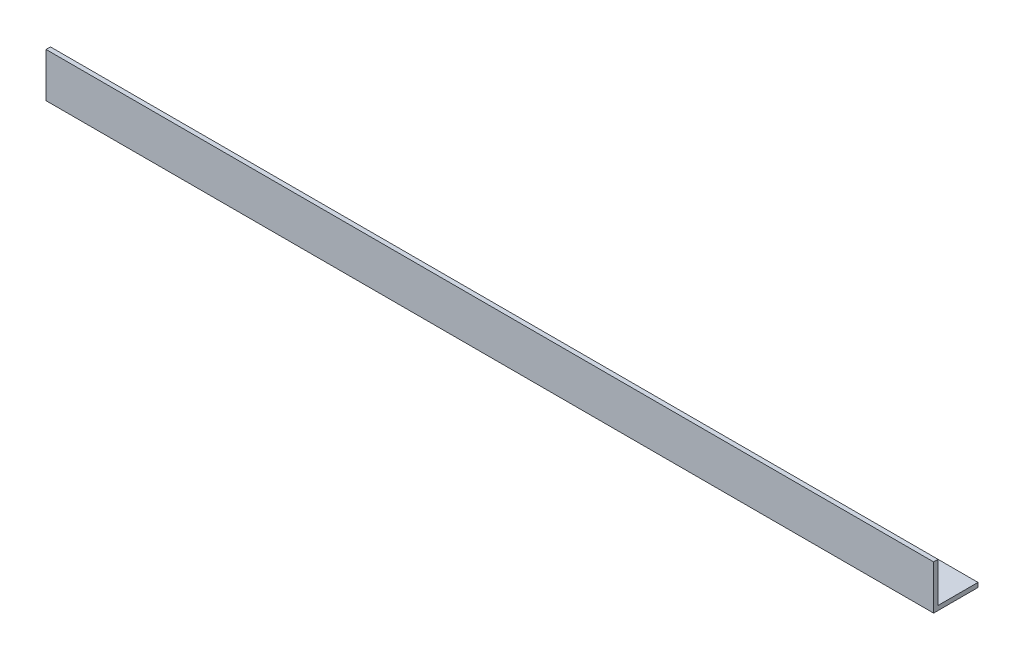
ISO-10303-21;
HEADER;
FILE_DESCRIPTION(('STEP AP214'),'2;1');
FILE_NAME('part.step','',(''),(''),'','','');
FILE_SCHEMA(('AUTOMOTIVE_DESIGN { 1 0 10303 214 1 1 1 1 }'));
ENDSEC;
DATA;
#1=APPLICATION_CONTEXT('core data for automotive mechanical design processes');
#2=APPLICATION_PROTOCOL_DEFINITION('international standard','automotive_design',2000,#1);
#3=PRODUCT_CONTEXT('',#1,'mechanical');
#4=PRODUCT('Part','Part','',(#3));
#5=PRODUCT_RELATED_PRODUCT_CATEGORY('part','',(#4));
#6=PRODUCT_DEFINITION_FORMATION('','',#4);
#7=PRODUCT_DEFINITION_CONTEXT('part definition',#1,'design');
#8=PRODUCT_DEFINITION('design','',#6,#7);
#9=PRODUCT_DEFINITION_SHAPE('','',#8);
#10=(LENGTH_UNIT() NAMED_UNIT(*) SI_UNIT(.MILLI.,.METRE.));
#11=(NAMED_UNIT(*) PLANE_ANGLE_UNIT() SI_UNIT($,.RADIAN.));
#12=(NAMED_UNIT(*) SI_UNIT($,.STERADIAN.) SOLID_ANGLE_UNIT());
#13=UNCERTAINTY_MEASURE_WITH_UNIT(LENGTH_MEASURE(1.E-05),#10,'distance_accuracy_value','');
#14=(GEOMETRIC_REPRESENTATION_CONTEXT(3) GLOBAL_UNCERTAINTY_ASSIGNED_CONTEXT((#13)) GLOBAL_UNIT_ASSIGNED_CONTEXT((#10,
#11,#12)) REPRESENTATION_CONTEXT('',''));
#15=CARTESIAN_POINT('',(0.,0.,0.));
#16=DIRECTION('',(0.,0.,1.));
#17=DIRECTION('',(1.,0.,0.));
#18=AXIS2_PLACEMENT_3D('',#15,#16,#17);
#19=CARTESIAN_POINT('',(300.,0.,-15.));
#20=DIRECTION('',(0.,1.,0.));
#21=DIRECTION('',(0.,0.,1.));
#22=AXIS2_PLACEMENT_3D('',#19,#20,#21);
#23=PLANE('',#22);
#24=DIRECTION('',(0.,0.,-1.));
#25=VECTOR('',#24,1.);
#26=CARTESIAN_POINT('',(0.,0.,-15.));
#27=LINE('',#26,#25);
#28=CARTESIAN_POINT('',(0.,0.,0.));
#29=VERTEX_POINT('',#28);
#30=CARTESIAN_POINT('',(0.,0.,-15.));
#31=VERTEX_POINT('',#30);
#32=EDGE_CURVE('E119',#29,#31,#27,.T.);
#33=ORIENTED_EDGE('',*,*,#32,.T.);
#34=DIRECTION('',(-1.,0.,0.));
#35=VECTOR('',#34,1.);
#36=CARTESIAN_POINT('',(300.,0.,-15.));
#37=LINE('',#36,#35);
#38=CARTESIAN_POINT('',(300.,0.,-15.));
#39=VERTEX_POINT('',#38);
#40=EDGE_CURVE('E11',#39,#31,#37,.T.);
#41=ORIENTED_EDGE('',*,*,#40,.F.);
#42=DIRECTION('',(0.,0.,-1.));
#43=VECTOR('',#42,1.);
#44=CARTESIAN_POINT('',(300.,0.,-15.));
#45=LINE('',#44,#43);
#46=CARTESIAN_POINT('',(300.,0.,0.));
#47=VERTEX_POINT('',#46);
#48=EDGE_CURVE('E129',#47,#39,#45,.T.);
#49=ORIENTED_EDGE('',*,*,#48,.F.);
#50=DIRECTION('',(-1.,0.,0.));
#51=VECTOR('',#50,1.);
#52=CARTESIAN_POINT('',(300.,0.,0.));
#53=LINE('',#52,#51);
#54=EDGE_CURVE('E115',#47,#29,#53,.T.);
#55=ORIENTED_EDGE('',*,*,#54,.T.);
#56=EDGE_LOOP('',(#33,#41,#49,#55));
#57=FACE_BOUND('',#56,.T.);
#58=ADVANCED_FACE('F35',(#57),#23,.F.);
#59=CARTESIAN_POINT('',(300.,1.49999999999998,-15.));
#60=DIRECTION('',(0.,0.,1.));
#61=DIRECTION('',(1.,0.,0.));
#62=AXIS2_PLACEMENT_3D('',#59,#60,#61);
#63=PLANE('',#62);
#64=DIRECTION('',(0.,1.,0.));
#65=VECTOR('',#64,1.);
#66=CARTESIAN_POINT('',(0.,1.49999999999998,-15.));
#67=LINE('',#66,#65);
#68=CARTESIAN_POINT('',(0.,1.49999999999998,-15.));
#69=VERTEX_POINT('',#68);
#70=EDGE_CURVE('E122',#31,#69,#67,.T.);
#71=ORIENTED_EDGE('',*,*,#70,.T.);
#72=DIRECTION('',(-1.,0.,0.));
#73=VECTOR('',#72,1.);
#74=CARTESIAN_POINT('',(300.,1.49999999999998,-15.));
#75=LINE('',#74,#73);
#76=CARTESIAN_POINT('',(300.,1.49999999999998,-15.));
#77=VERTEX_POINT('',#76);
#78=EDGE_CURVE('E43',#77,#69,#75,.T.);
#79=ORIENTED_EDGE('',*,*,#78,.F.);
#80=DIRECTION('',(0.,1.,0.));
#81=VECTOR('',#80,1.);
#82=CARTESIAN_POINT('',(300.,1.49999999999998,-15.));
#83=LINE('',#82,#81);
#84=EDGE_CURVE('E88',#39,#77,#83,.T.);
#85=ORIENTED_EDGE('',*,*,#84,.F.);
#86=ORIENTED_EDGE('',*,*,#40,.T.);
#87=EDGE_LOOP('',(#71,#79,#85,#86));
#88=FACE_BOUND('',#87,.T.);
#89=ADVANCED_FACE('F153',(#88),#63,.F.);
#90=CARTESIAN_POINT('',(300.,1.5,-1.50000000000002));
#91=DIRECTION('',(0.,-1.,0.));
#92=DIRECTION('',(0.,0.,-1.));
#93=AXIS2_PLACEMENT_3D('',#90,#91,#92);
#94=PLANE('',#93);
#95=DIRECTION('',(0.,0.,1.));
#96=VECTOR('',#95,1.);
#97=CARTESIAN_POINT('',(0.,1.5,-1.50000000000002));
#98=LINE('',#97,#96);
#99=CARTESIAN_POINT('',(0.,1.5,-1.50000000000002));
#100=VERTEX_POINT('',#99);
#101=EDGE_CURVE('E124',#69,#100,#98,.T.);
#102=ORIENTED_EDGE('',*,*,#101,.T.);
#103=DIRECTION('',(-1.,0.,0.));
#104=VECTOR('',#103,1.);
#105=CARTESIAN_POINT('',(300.,1.5,-1.50000000000002));
#106=LINE('',#105,#104);
#107=CARTESIAN_POINT('',(300.,1.5,-1.50000000000002));
#108=VERTEX_POINT('',#107);
#109=EDGE_CURVE('E110',#108,#100,#106,.T.);
#110=ORIENTED_EDGE('',*,*,#109,.F.);
#111=DIRECTION('',(0.,0.,1.));
#112=VECTOR('',#111,1.);
#113=CARTESIAN_POINT('',(300.,1.5,-1.50000000000002));
#114=LINE('',#113,#112);
#115=EDGE_CURVE('E101',#77,#108,#114,.T.);
#116=ORIENTED_EDGE('',*,*,#115,.F.);
#117=ORIENTED_EDGE('',*,*,#78,.T.);
#118=EDGE_LOOP('',(#102,#110,#116,#117));
#119=FACE_BOUND('',#118,.T.);
#120=ADVANCED_FACE('F135',(#119),#94,.F.);
#121=CARTESIAN_POINT('',(300.,15.,-1.5));
#122=DIRECTION('',(0.,0.,1.));
#123=DIRECTION('',(0.,-1.,0.));
#124=AXIS2_PLACEMENT_3D('',#121,#122,#123);
#125=PLANE('',#124);
#126=DIRECTION('',(0.,1.,0.));
#127=VECTOR('',#126,1.);
#128=CARTESIAN_POINT('',(0.,15.,-1.5));
#129=LINE('',#128,#127);
#130=CARTESIAN_POINT('',(0.,15.,-1.5));
#131=VERTEX_POINT('',#130);
#132=EDGE_CURVE('E109',#100,#131,#129,.T.);
#133=ORIENTED_EDGE('',*,*,#132,.T.);
#134=DIRECTION('',(-1.,0.,0.));
#135=VECTOR('',#134,1.);
#136=CARTESIAN_POINT('',(300.,15.,-1.5));
#137=LINE('',#136,#135);
#138=CARTESIAN_POINT('',(300.,15.,-1.5));
#139=VERTEX_POINT('',#138);
#140=EDGE_CURVE('E106',#139,#131,#137,.T.);
#141=ORIENTED_EDGE('',*,*,#140,.F.);
#142=DIRECTION('',(0.,1.,0.));
#143=VECTOR('',#142,1.);
#144=CARTESIAN_POINT('',(300.,15.,-1.5));
#145=LINE('',#144,#143);
#146=EDGE_CURVE('E95',#108,#139,#145,.T.);
#147=ORIENTED_EDGE('',*,*,#146,.F.);
#148=ORIENTED_EDGE('',*,*,#109,.T.);
#149=EDGE_LOOP('',(#133,#141,#147,#148));
#150=FACE_BOUND('',#149,.T.);
#151=ADVANCED_FACE('F107',(#150),#125,.F.);
#152=CARTESIAN_POINT('',(300.,15.,0.));
#153=DIRECTION('',(0.,-1.,0.));
#154=DIRECTION('',(0.,0.,-1.));
#155=AXIS2_PLACEMENT_3D('',#152,#153,#154);
#156=PLANE('',#155);
#157=DIRECTION('',(0.,0.,1.));
#158=VECTOR('',#157,1.);
#159=CARTESIAN_POINT('',(0.,15.,0.));
#160=LINE('',#159,#158);
#161=CARTESIAN_POINT('',(0.,15.,0.));
#162=VERTEX_POINT('',#161);
#163=EDGE_CURVE('E74',#131,#162,#160,.T.);
#164=ORIENTED_EDGE('',*,*,#163,.T.);
#165=DIRECTION('',(-1.,0.,0.));
#166=VECTOR('',#165,1.);
#167=CARTESIAN_POINT('',(300.,15.,0.));
#168=LINE('',#167,#166);
#169=CARTESIAN_POINT('',(300.,15.,0.));
#170=VERTEX_POINT('',#169);
#171=EDGE_CURVE('E111',#170,#162,#168,.T.);
#172=ORIENTED_EDGE('',*,*,#171,.F.);
#173=DIRECTION('',(0.,0.,1.));
#174=VECTOR('',#173,1.);
#175=CARTESIAN_POINT('',(300.,15.,0.));
#176=LINE('',#175,#174);
#177=EDGE_CURVE('E99',#139,#170,#176,.T.);
#178=ORIENTED_EDGE('',*,*,#177,.F.);
#179=ORIENTED_EDGE('',*,*,#140,.T.);
#180=EDGE_LOOP('',(#164,#172,#178,#179));
#181=FACE_BOUND('',#180,.T.);
#182=ADVANCED_FACE('F113',(#181),#156,.F.);
#183=CARTESIAN_POINT('',(300.,0.,0.));
#184=DIRECTION('',(0.,0.,-1.));
#185=DIRECTION('',(-1.,0.,0.));
#186=AXIS2_PLACEMENT_3D('',#183,#184,#185);
#187=PLANE('',#186);
#188=DIRECTION('',(0.,-1.,0.));
#189=VECTOR('',#188,1.);
#190=CARTESIAN_POINT('',(0.,0.,0.));
#191=LINE('',#190,#189);
#192=EDGE_CURVE('E80',#162,#29,#191,.T.);
#193=ORIENTED_EDGE('',*,*,#192,.T.);
#194=ORIENTED_EDGE('',*,*,#54,.F.);
#195=DIRECTION('',(0.,-1.,0.));
#196=VECTOR('',#195,1.);
#197=CARTESIAN_POINT('',(300.,0.,0.));
#198=LINE('',#197,#196);
#199=EDGE_CURVE('E51',#170,#47,#198,.T.);
#200=ORIENTED_EDGE('',*,*,#199,.F.);
#201=ORIENTED_EDGE('',*,*,#171,.T.);
#202=EDGE_LOOP('',(#193,#194,#200,#201));
#203=FACE_BOUND('',#202,.T.);
#204=ADVANCED_FACE('F142',(#203),#187,.F.);
#205=CARTESIAN_POINT('',(300.,0.,0.));
#206=DIRECTION('',(-1.,0.,0.));
#207=DIRECTION('',(0.,0.,1.));
#208=AXIS2_PLACEMENT_3D('',#205,#206,#207);
#209=PLANE('',#208);
#210=ORIENTED_EDGE('',*,*,#48,.T.);
#211=ORIENTED_EDGE('',*,*,#84,.T.);
#212=ORIENTED_EDGE('',*,*,#115,.T.);
#213=ORIENTED_EDGE('',*,*,#146,.T.);
#214=ORIENTED_EDGE('',*,*,#177,.T.);
#215=ORIENTED_EDGE('',*,*,#199,.T.);
#216=EDGE_LOOP('',(#210,#211,#212,#213,#214,#215));
#217=FACE_BOUND('',#216,.T.);
#218=ADVANCED_FACE('F97',(#217),#209,.F.);
#219=CARTESIAN_POINT('',(0.,0.,0.));
#220=DIRECTION('',(-1.,0.,0.));
#221=DIRECTION('',(0.,0.,1.));
#222=AXIS2_PLACEMENT_3D('',#219,#220,#221);
#223=PLANE('',#222);
#224=ORIENTED_EDGE('',*,*,#32,.F.);
#225=ORIENTED_EDGE('',*,*,#192,.F.);
#226=ORIENTED_EDGE('',*,*,#163,.F.);
#227=ORIENTED_EDGE('',*,*,#132,.F.);
#228=ORIENTED_EDGE('',*,*,#101,.F.);
#229=ORIENTED_EDGE('',*,*,#70,.F.);
#230=EDGE_LOOP('',(#224,#225,#226,#227,#228,#229));
#231=FACE_BOUND('',#230,.T.);
#232=ADVANCED_FACE('F138',(#231),#223,.T.);
#233=CLOSED_SHELL('',(#58,#89,#120,#151,#182,#204,#218,#232));
#234=MANIFOLD_SOLID_BREP('B2',#233);
#235=ADVANCED_BREP_SHAPE_REPRESENTATION('',(#18,#234),#14);
#236=SHAPE_DEFINITION_REPRESENTATION(#9,#235);
ENDSEC;
END-ISO-10303-21;
